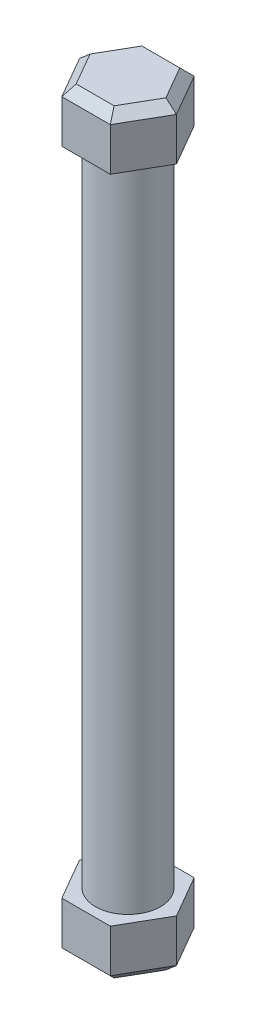
ISO-10303-21;
HEADER;
FILE_DESCRIPTION(('STEP AP214'),'2;1');
FILE_NAME('part.step','',(''),(''),'','','');
FILE_SCHEMA(('AUTOMOTIVE_DESIGN { 1 0 10303 214 1 1 1 1 }'));
ENDSEC;
DATA;
#1=APPLICATION_CONTEXT('core data for automotive mechanical design processes');
#2=APPLICATION_PROTOCOL_DEFINITION('international standard','automotive_design',2000,#1);
#3=PRODUCT_CONTEXT('',#1,'mechanical');
#4=PRODUCT('Part','Part','',(#3));
#5=PRODUCT_RELATED_PRODUCT_CATEGORY('part','',(#4));
#6=PRODUCT_DEFINITION_FORMATION('','',#4);
#7=PRODUCT_DEFINITION_CONTEXT('part definition',#1,'design');
#8=PRODUCT_DEFINITION('design','',#6,#7);
#9=PRODUCT_DEFINITION_SHAPE('','',#8);
#10=(LENGTH_UNIT() NAMED_UNIT(*) SI_UNIT(.MILLI.,.METRE.));
#11=(NAMED_UNIT(*) PLANE_ANGLE_UNIT() SI_UNIT($,.RADIAN.));
#12=(NAMED_UNIT(*) SI_UNIT($,.STERADIAN.) SOLID_ANGLE_UNIT());
#13=UNCERTAINTY_MEASURE_WITH_UNIT(LENGTH_MEASURE(1.E-05),#10,'distance_accuracy_value','');
#14=(GEOMETRIC_REPRESENTATION_CONTEXT(3) GLOBAL_UNCERTAINTY_ASSIGNED_CONTEXT((#13)) GLOBAL_UNIT_ASSIGNED_CONTEXT((#10,
#11,#12)) REPRESENTATION_CONTEXT('',''));
#15=CARTESIAN_POINT('',(0.,0.,0.));
#16=DIRECTION('',(0.,0.,1.));
#17=DIRECTION('',(1.,0.,0.));
#18=AXIS2_PLACEMENT_3D('',#15,#16,#17);
#19=CARTESIAN_POINT('',(0.,50.,0.));
#20=DIRECTION('',(0.,-1.,0.));
#21=DIRECTION('',(0.,0.,-1.));
#22=AXIS2_PLACEMENT_3D('',#19,#20,#21);
#23=CYLINDRICAL_SURFACE('',#22,2.5);
#24=CARTESIAN_POINT('',(0.,50.,0.));
#25=DIRECTION('',(0.,1.,0.));
#26=DIRECTION('',(0.,0.,1.));
#27=AXIS2_PLACEMENT_3D('',#24,#25,#26);
#28=CIRCLE('',#27,2.5);
#29=CARTESIAN_POINT('',(0.,50.,2.5));
#30=VERTEX_POINT('',#29);
#31=EDGE_CURVE('E268',#30,#30,#28,.T.);
#32=ORIENTED_EDGE('',*,*,#31,.F.);
#33=EDGE_LOOP('',(#32));
#34=FACE_BOUND('',#33,.T.);
#35=CARTESIAN_POINT('',(0.,0.,0.));
#36=DIRECTION('',(0.,1.,0.));
#37=DIRECTION('',(0.,0.,1.));
#38=AXIS2_PLACEMENT_3D('',#35,#36,#37);
#39=CIRCLE('',#38,2.5);
#40=CARTESIAN_POINT('',(0.,0.,2.5));
#41=VERTEX_POINT('',#40);
#42=EDGE_CURVE('E176',#41,#41,#39,.T.);
#43=ORIENTED_EDGE('',*,*,#42,.T.);
#44=EDGE_LOOP('',(#43));
#45=FACE_BOUND('',#44,.T.);
#46=ADVANCED_FACE('F41',(#34,#45),#23,.T.);
#47=CARTESIAN_POINT('',(1.86001855861433,54.,3.22164664654096));
#48=DIRECTION('',(-0.866025403784441,0.,-0.499999999999995));
#49=DIRECTION('',(-0.499999999999995,0.,0.866025403784442));
#50=AXIS2_PLACEMENT_3D('',#47,#48,#49);
#51=PLANE('',#50);
#52=DIRECTION('',(0.,-1.,0.));
#53=VECTOR('',#52,1.);
#54=CARTESIAN_POINT('',(3.72003711722858,54.,0.));
#55=LINE('',#54,#53);
#56=CARTESIAN_POINT('',(3.72003711722858,53.3,0.));
#57=VERTEX_POINT('',#56);
#58=CARTESIAN_POINT('',(3.72003711722858,50.,0.));
#59=VERTEX_POINT('',#58);
#60=EDGE_CURVE('E265',#57,#59,#55,.T.);
#61=ORIENTED_EDGE('',*,*,#60,.F.);
#62=DIRECTION('',(-0.499999999999995,0.,0.866025403784442));
#63=VECTOR('',#62,1.);
#64=CARTESIAN_POINT('',(1.86001855861433,53.3,3.22164664654096));
#65=LINE('',#64,#63);
#66=CARTESIAN_POINT('',(1.86001855861433,53.3,3.22164664654096));
#67=VERTEX_POINT('',#66);
#68=EDGE_CURVE('E311',#57,#67,#65,.T.);
#69=ORIENTED_EDGE('',*,*,#68,.T.);
#70=DIRECTION('',(0.,-1.,0.));
#71=VECTOR('',#70,1.);
#72=CARTESIAN_POINT('',(1.86001855861433,54.,3.22164664654096));
#73=LINE('',#72,#71);
#74=CARTESIAN_POINT('',(1.86001855861433,50.,3.22164664654096));
#75=VERTEX_POINT('',#74);
#76=EDGE_CURVE('E250',#67,#75,#73,.T.);
#77=ORIENTED_EDGE('',*,*,#76,.T.);
#78=DIRECTION('',(0.499999999999995,0.,-0.866025403784441));
#79=VECTOR('',#78,1.);
#80=CARTESIAN_POINT('',(1.86001855861433,50.,3.22164664654096));
#81=LINE('',#80,#79);
#82=EDGE_CURVE('E225',#75,#59,#81,.T.);
#83=ORIENTED_EDGE('',*,*,#82,.T.);
#84=EDGE_LOOP('',(#61,#69,#77,#83));
#85=FACE_BOUND('',#84,.T.);
#86=ADVANCED_FACE('F427',(#85),#51,.F.);
#87=CARTESIAN_POINT('',(3.72003711722858,54.,0.));
#88=DIRECTION('',(-0.866025403784438,0.,0.500000000000001));
#89=DIRECTION('',(0.500000000000001,0.,0.866025403784438));
#90=AXIS2_PLACEMENT_3D('',#87,#88,#89);
#91=PLANE('',#90);
#92=DIRECTION('',(0.,-1.,0.));
#93=VECTOR('',#92,1.);
#94=CARTESIAN_POINT('',(1.86001855861428,54.,-3.22164664654098));
#95=LINE('',#94,#93);
#96=CARTESIAN_POINT('',(1.86001855861428,53.3,-3.22164664654098));
#97=VERTEX_POINT('',#96);
#98=CARTESIAN_POINT('',(1.86001855861428,50.,-3.22164664654098));
#99=VERTEX_POINT('',#98);
#100=EDGE_CURVE('E262',#97,#99,#95,.T.);
#101=ORIENTED_EDGE('',*,*,#100,.F.);
#102=DIRECTION('',(0.500000000000001,0.,0.866025403784438));
#103=VECTOR('',#102,1.);
#104=CARTESIAN_POINT('',(3.72003711722858,53.3,0.));
#105=LINE('',#104,#103);
#106=EDGE_CURVE('E308',#97,#57,#105,.T.);
#107=ORIENTED_EDGE('',*,*,#106,.T.);
#108=ORIENTED_EDGE('',*,*,#60,.T.);
#109=DIRECTION('',(-0.500000000000001,0.,-0.866025403784438));
#110=VECTOR('',#109,1.);
#111=CARTESIAN_POINT('',(3.72003711722858,50.,0.));
#112=LINE('',#111,#110);
#113=EDGE_CURVE('E229',#59,#99,#112,.T.);
#114=ORIENTED_EDGE('',*,*,#113,.T.);
#115=EDGE_LOOP('',(#101,#107,#108,#114));
#116=FACE_BOUND('',#115,.T.);
#117=ADVANCED_FACE('F433',(#116),#91,.F.);
#118=CARTESIAN_POINT('',(1.86001855861428,54.,-3.22164664654098));
#119=DIRECTION('',(0.,0.,1.));
#120=DIRECTION('',(1.,0.,0.));
#121=AXIS2_PLACEMENT_3D('',#118,#119,#120);
#122=PLANE('',#121);
#123=DIRECTION('',(0.,-1.,0.));
#124=VECTOR('',#123,1.);
#125=CARTESIAN_POINT('',(-1.8600185586143,54.,-3.22164664654097));
#126=LINE('',#125,#124);
#127=CARTESIAN_POINT('',(-1.8600185586143,53.3,-3.22164664654097));
#128=VERTEX_POINT('',#127);
#129=CARTESIAN_POINT('',(-1.8600185586143,50.,-3.22164664654097));
#130=VERTEX_POINT('',#129);
#131=EDGE_CURVE('E259',#128,#130,#126,.T.);
#132=ORIENTED_EDGE('',*,*,#131,.F.);
#133=DIRECTION('',(1.,0.,0.));
#134=VECTOR('',#133,1.);
#135=CARTESIAN_POINT('',(1.86001855861428,53.3,-3.22164664654098));
#136=LINE('',#135,#134);
#137=EDGE_CURVE('E305',#128,#97,#136,.T.);
#138=ORIENTED_EDGE('',*,*,#137,.T.);
#139=ORIENTED_EDGE('',*,*,#100,.T.);
#140=DIRECTION('',(-1.,0.,0.));
#141=VECTOR('',#140,1.);
#142=CARTESIAN_POINT('',(1.86001855861428,50.,-3.22164664654098));
#143=LINE('',#142,#141);
#144=EDGE_CURVE('E234',#99,#130,#143,.T.);
#145=ORIENTED_EDGE('',*,*,#144,.T.);
#146=EDGE_LOOP('',(#132,#138,#139,#145));
#147=FACE_BOUND('',#146,.T.);
#148=ADVANCED_FACE('F668',(#147),#122,.F.);
#149=CARTESIAN_POINT('',(-1.8600185586143,54.,-3.22164664654097));
#150=DIRECTION('',(0.866025403784442,0.,0.499999999999995));
#151=DIRECTION('',(0.499999999999995,0.,-0.866025403784442));
#152=AXIS2_PLACEMENT_3D('',#149,#150,#151);
#153=PLANE('',#152);
#154=DIRECTION('',(0.,-1.,0.));
#155=VECTOR('',#154,1.);
#156=CARTESIAN_POINT('',(-3.72003711722858,54.,0.));
#157=LINE('',#156,#155);
#158=CARTESIAN_POINT('',(-3.72003711722858,53.3,0.));
#159=VERTEX_POINT('',#158);
#160=CARTESIAN_POINT('',(-3.72003711722858,50.,0.));
#161=VERTEX_POINT('',#160);
#162=EDGE_CURVE('E256',#159,#161,#157,.T.);
#163=ORIENTED_EDGE('',*,*,#162,.F.);
#164=DIRECTION('',(0.499999999999995,0.,-0.866025403784442));
#165=VECTOR('',#164,1.);
#166=CARTESIAN_POINT('',(-1.8600185586143,53.3,-3.22164664654097));
#167=LINE('',#166,#165);
#168=EDGE_CURVE('E302',#159,#128,#167,.T.);
#169=ORIENTED_EDGE('',*,*,#168,.T.);
#170=ORIENTED_EDGE('',*,*,#131,.T.);
#171=DIRECTION('',(-0.499999999999995,0.,0.866025403784441));
#172=VECTOR('',#171,1.);
#173=CARTESIAN_POINT('',(-1.8600185586143,50.,-3.22164664654097));
#174=LINE('',#173,#172);
#175=EDGE_CURVE('E238',#130,#161,#174,.T.);
#176=ORIENTED_EDGE('',*,*,#175,.T.);
#177=EDGE_LOOP('',(#163,#169,#170,#176));
#178=FACE_BOUND('',#177,.T.);
#179=ADVANCED_FACE('F659',(#178),#153,.F.);
#180=CARTESIAN_POINT('',(-3.72003711722858,54.,0.));
#181=DIRECTION('',(0.866025403784435,0.,-0.500000000000007));
#182=DIRECTION('',(-0.500000000000007,0.,-0.866025403784435));
#183=AXIS2_PLACEMENT_3D('',#180,#181,#182);
#184=PLANE('',#183);
#185=DIRECTION('',(0.,-1.,0.));
#186=VECTOR('',#185,1.);
#187=CARTESIAN_POINT('',(-1.86001855861426,54.,3.221646646541));
#188=LINE('',#187,#186);
#189=CARTESIAN_POINT('',(-1.86001855861426,53.3,3.221646646541));
#190=VERTEX_POINT('',#189);
#191=CARTESIAN_POINT('',(-1.86001855861426,50.,3.221646646541));
#192=VERTEX_POINT('',#191);
#193=EDGE_CURVE('E253',#190,#192,#188,.T.);
#194=ORIENTED_EDGE('',*,*,#193,.F.);
#195=DIRECTION('',(-0.500000000000007,0.,-0.866025403784435));
#196=VECTOR('',#195,1.);
#197=CARTESIAN_POINT('',(-3.72003711722858,53.3,0.));
#198=LINE('',#197,#196);
#199=EDGE_CURVE('E299',#190,#159,#198,.T.);
#200=ORIENTED_EDGE('',*,*,#199,.T.);
#201=ORIENTED_EDGE('',*,*,#162,.T.);
#202=DIRECTION('',(0.500000000000007,0.,0.866025403784435));
#203=VECTOR('',#202,1.);
#204=CARTESIAN_POINT('',(-3.72003711722858,50.,0.));
#205=LINE('',#204,#203);
#206=EDGE_CURVE('E242',#161,#192,#205,.T.);
#207=ORIENTED_EDGE('',*,*,#206,.T.);
#208=EDGE_LOOP('',(#194,#200,#201,#207));
#209=FACE_BOUND('',#208,.T.);
#210=ADVANCED_FACE('F650',(#209),#184,.F.);
#211=CARTESIAN_POINT('',(-1.86001855861426,54.,3.221646646541));
#212=DIRECTION('',(0.,0.,-1.));
#213=DIRECTION('',(-1.,0.,0.));
#214=AXIS2_PLACEMENT_3D('',#211,#212,#213);
#215=PLANE('',#214);
#216=ORIENTED_EDGE('',*,*,#76,.F.);
#217=DIRECTION('',(-1.,0.,0.));
#218=VECTOR('',#217,1.);
#219=CARTESIAN_POINT('',(-1.86001855861426,53.3,3.221646646541));
#220=LINE('',#219,#218);
#221=EDGE_CURVE('E295',#67,#190,#220,.T.);
#222=ORIENTED_EDGE('',*,*,#221,.T.);
#223=ORIENTED_EDGE('',*,*,#193,.T.);
#224=DIRECTION('',(1.,0.,0.));
#225=VECTOR('',#224,1.);
#226=CARTESIAN_POINT('',(-1.86001855861426,50.,3.221646646541));
#227=LINE('',#226,#225);
#228=EDGE_CURVE('E246',#192,#75,#227,.T.);
#229=ORIENTED_EDGE('',*,*,#228,.T.);
#230=EDGE_LOOP('',(#216,#222,#223,#229));
#231=FACE_BOUND('',#230,.T.);
#232=ADVANCED_FACE('F641',(#231),#215,.F.);
#233=CARTESIAN_POINT('',(0.,54.,0.));
#234=DIRECTION('',(0.,1.,0.));
#235=DIRECTION('',(0.,0.,1.));
#236=AXIS2_PLACEMENT_3D('',#233,#234,#235);
#237=PLANE('',#236);
#238=DIRECTION('',(0.500000000000007,0.,0.866025403784435));
#239=VECTOR('',#238,1.);
#240=CARTESIAN_POINT('',(-1.25380077596517,54.,2.871646646541));
#241=LINE('',#240,#239);
#242=CARTESIAN_POINT('',(-2.91174674036312,54.,0.));
#243=VERTEX_POINT('',#242);
#244=CARTESIAN_POINT('',(-1.45587337018154,54.,2.52164664654101));
#245=VERTEX_POINT('',#244);
#246=EDGE_CURVE('E288',#243,#245,#241,.T.);
#247=ORIENTED_EDGE('',*,*,#246,.T.);
#248=DIRECTION('',(1.,0.,0.));
#249=VECTOR('',#248,1.);
#250=CARTESIAN_POINT('',(1.86001855861432,54.,2.52164664654097));
#251=LINE('',#250,#249);
#252=CARTESIAN_POINT('',(1.45587337018159,54.,2.52164664654098));
#253=VERTEX_POINT('',#252);
#254=EDGE_CURVE('E291',#245,#253,#251,.T.);
#255=ORIENTED_EDGE('',*,*,#254,.T.);
#256=DIRECTION('',(0.499999999999995,0.,-0.866025403784442));
#257=VECTOR('',#256,1.);
#258=CARTESIAN_POINT('',(3.11381933457948,54.,-0.349999999999989));
#259=LINE('',#258,#257);
#260=CARTESIAN_POINT('',(2.91174674036312,54.,0.));
#261=VERTEX_POINT('',#260);
#262=EDGE_CURVE('E272',#253,#261,#259,.T.);
#263=ORIENTED_EDGE('',*,*,#262,.T.);
#264=DIRECTION('',(-0.500000000000001,0.,-0.866025403784438));
#265=VECTOR('',#264,1.);
#266=CARTESIAN_POINT('',(1.25380077596519,54.,-2.87164664654099));
#267=LINE('',#266,#265);
#268=CARTESIAN_POINT('',(1.45587337018155,54.,-2.521646646541));
#269=VERTEX_POINT('',#268);
#270=EDGE_CURVE('E279',#261,#269,#267,.T.);
#271=ORIENTED_EDGE('',*,*,#270,.T.);
#272=DIRECTION('',(-1.,0.,0.));
#273=VECTOR('',#272,1.);
#274=CARTESIAN_POINT('',(-1.8600185586143,54.,-2.52164664654099));
#275=LINE('',#274,#273);
#276=CARTESIAN_POINT('',(-1.45587337018157,54.,-2.52164664654099));
#277=VERTEX_POINT('',#276);
#278=EDGE_CURVE('E282',#269,#277,#275,.T.);
#279=ORIENTED_EDGE('',*,*,#278,.T.);
#280=DIRECTION('',(-0.499999999999995,0.,0.866025403784442));
#281=VECTOR('',#280,1.);
#282=CARTESIAN_POINT('',(-3.11381933457948,54.,0.350000000000016));
#283=LINE('',#282,#281);
#284=EDGE_CURVE('E285',#277,#243,#283,.T.);
#285=ORIENTED_EDGE('',*,*,#284,.T.);
#286=EDGE_LOOP('',(#247,#255,#263,#271,#279,#285));
#287=FACE_BOUND('',#286,.T.);
#288=ADVANCED_FACE('F632',(#287),#237,.T.);
#289=CARTESIAN_POINT('',(0.,50.,0.));
#290=DIRECTION('',(0.,1.,0.));
#291=DIRECTION('',(0.,0.,1.));
#292=AXIS2_PLACEMENT_3D('',#289,#290,#291);
#293=PLANE('',#292);
#294=ORIENTED_EDGE('',*,*,#31,.T.);
#295=EDGE_LOOP('',(#294));
#296=FACE_BOUND('',#295,.T.);
#297=ORIENTED_EDGE('',*,*,#82,.F.);
#298=ORIENTED_EDGE('',*,*,#228,.F.);
#299=ORIENTED_EDGE('',*,*,#206,.F.);
#300=ORIENTED_EDGE('',*,*,#175,.F.);
#301=ORIENTED_EDGE('',*,*,#144,.F.);
#302=ORIENTED_EDGE('',*,*,#113,.F.);
#303=EDGE_LOOP('',(#297,#298,#299,#300,#301,#302));
#304=FACE_BOUND('',#303,.T.);
#305=ADVANCED_FACE('F481',(#296,#304),#293,.F.);
#306=CARTESIAN_POINT('',(0.,54.,-2.52164664654099));
#307=DIRECTION('',(0.,0.707106781186544,-0.70710678118655));
#308=DIRECTION('',(1.,0.,0.));
#309=AXIS2_PLACEMENT_3D('',#306,#307,#308);
#310=PLANE('',#309);
#311=DIRECTION('',(-0.377964473009225,0.65465367070798,0.654653670707976));
#312=VECTOR('',#311,1.);
#313=CARTESIAN_POINT('',(1.24789146015562,54.3602352352202,-2.16141141132086));
#314=LINE('',#313,#312);
#315=EDGE_CURVE('E328',#97,#269,#314,.T.);
#316=ORIENTED_EDGE('',*,*,#315,.F.);
#317=ORIENTED_EDGE('',*,*,#137,.F.);
#318=DIRECTION('',(0.377964473009229,0.65465367070798,0.654653670707973));
#319=VECTOR('',#318,1.);
#320=CARTESIAN_POINT('',(-1.24789146015563,54.3602352352202,-2.16141141132085));
#321=LINE('',#320,#319);
#322=EDGE_CURVE('E230',#277,#128,#321,.F.);
#323=ORIENTED_EDGE('',*,*,#322,.F.);
#324=ORIENTED_EDGE('',*,*,#278,.F.);
#325=EDGE_LOOP('',(#316,#317,#323,#324));
#326=FACE_BOUND('',#325,.T.);
#327=ADVANCED_FACE('F475',(#326),#310,.T.);
#328=CARTESIAN_POINT('',(-2.18381005527235,54.,-1.26082332327048));
#329=DIRECTION('',(-0.612372435695799,0.707106781186544,-0.353553390593272));
#330=DIRECTION('',(0.499999999999995,0.,-0.866025403784442));
#331=AXIS2_PLACEMENT_3D('',#328,#329,#330);
#332=PLANE('',#331);
#333=ORIENTED_EDGE('',*,*,#322,.T.);
#334=ORIENTED_EDGE('',*,*,#168,.F.);
#335=DIRECTION('',(0.755928946018452,0.65465367070798,0.));
#336=VECTOR('',#335,1.);
#337=CARTESIAN_POINT('',(-2.49578292031125,54.3602352352202,0.));
#338=LINE('',#337,#336);
#339=EDGE_CURVE('E324',#243,#159,#338,.F.);
#340=ORIENTED_EDGE('',*,*,#339,.F.);
#341=ORIENTED_EDGE('',*,*,#284,.F.);
#342=EDGE_LOOP('',(#333,#334,#340,#341));
#343=FACE_BOUND('',#342,.T.);
#344=ADVANCED_FACE('F468',(#343),#332,.T.);
#345=CARTESIAN_POINT('',(2.18381005527234,54.,-1.2608233232705));
#346=DIRECTION('',(0.612372435695797,0.707106781186544,-0.353553390593276));
#347=DIRECTION('',(0.500000000000001,0.,0.866025403784438));
#348=AXIS2_PLACEMENT_3D('',#345,#346,#347);
#349=PLANE('',#348);
#350=ORIENTED_EDGE('',*,*,#315,.T.);
#351=ORIENTED_EDGE('',*,*,#270,.F.);
#352=DIRECTION('',(-0.755928946018451,0.654653670707981,0.));
#353=VECTOR('',#352,1.);
#354=CARTESIAN_POINT('',(2.49578292031126,54.3602352352201,0.));
#355=LINE('',#354,#353);
#356=EDGE_CURVE('E320',#57,#261,#355,.T.);
#357=ORIENTED_EDGE('',*,*,#356,.F.);
#358=ORIENTED_EDGE('',*,*,#106,.F.);
#359=EDGE_LOOP('',(#350,#351,#357,#358));
#360=FACE_BOUND('',#359,.T.);
#361=ADVANCED_FACE('F461',(#360),#349,.T.);
#362=CARTESIAN_POINT('',(-2.18381005527233,54.,1.26082332327051));
#363=DIRECTION('',(-0.612372435695794,0.707106781186544,0.35355339059328));
#364=DIRECTION('',(-0.500000000000007,0.,-0.866025403784435));
#365=AXIS2_PLACEMENT_3D('',#362,#363,#364);
#366=PLANE('',#365);
#367=ORIENTED_EDGE('',*,*,#339,.T.);
#368=ORIENTED_EDGE('',*,*,#199,.F.);
#369=DIRECTION('',(0.37796447300922,0.65465367070798,-0.654653670707979));
#370=VECTOR('',#369,1.);
#371=CARTESIAN_POINT('',(-1.2478914601556,54.3602352352202,2.16141141132086));
#372=LINE('',#371,#370);
#373=EDGE_CURVE('E317',#245,#190,#372,.F.);
#374=ORIENTED_EDGE('',*,*,#373,.F.);
#375=ORIENTED_EDGE('',*,*,#246,.F.);
#376=EDGE_LOOP('',(#367,#368,#374,#375));
#377=FACE_BOUND('',#376,.T.);
#378=ADVANCED_FACE('F454',(#377),#366,.T.);
#379=CARTESIAN_POINT('',(2.18381005527236,54.,1.26082332327049));
#380=DIRECTION('',(0.612372435695799,0.707106781186544,0.353553390593272));
#381=DIRECTION('',(-0.499999999999995,0.,0.866025403784442));
#382=AXIS2_PLACEMENT_3D('',#379,#380,#381);
#383=PLANE('',#382);
#384=ORIENTED_EDGE('',*,*,#356,.T.);
#385=ORIENTED_EDGE('',*,*,#262,.F.);
#386=DIRECTION('',(0.377964473009231,-0.654653670707981,0.654653670707972));
#387=VECTOR('',#386,1.);
#388=CARTESIAN_POINT('',(1.24789146015566,54.3602352352201,2.16141141132084));
#389=LINE('',#388,#387);
#390=EDGE_CURVE('E276',#67,#253,#389,.F.);
#391=ORIENTED_EDGE('',*,*,#390,.F.);
#392=ORIENTED_EDGE('',*,*,#68,.F.);
#393=EDGE_LOOP('',(#384,#385,#391,#392));
#394=FACE_BOUND('',#393,.T.);
#395=ADVANCED_FACE('F447',(#394),#383,.T.);
#396=CARTESIAN_POINT('',(0.,54.,2.52164664654099));
#397=DIRECTION('',(0.,0.707106781186545,0.70710678118655));
#398=DIRECTION('',(-1.,0.,0.));
#399=AXIS2_PLACEMENT_3D('',#396,#397,#398);
#400=PLANE('',#399);
#401=ORIENTED_EDGE('',*,*,#373,.T.);
#402=ORIENTED_EDGE('',*,*,#221,.F.);
#403=ORIENTED_EDGE('',*,*,#390,.T.);
#404=ORIENTED_EDGE('',*,*,#254,.F.);
#405=EDGE_LOOP('',(#401,#402,#403,#404));
#406=FACE_BOUND('',#405,.T.);
#407=ADVANCED_FACE('F441',(#406),#400,.T.);
#408=CARTESIAN_POINT('',(1.86001855861433,-4.,-3.22164664654096));
#409=DIRECTION('',(-0.866025403784441,0.,0.499999999999995));
#410=DIRECTION('',(0.499999999999995,0.,0.866025403784442));
#411=AXIS2_PLACEMENT_3D('',#408,#409,#410);
#412=PLANE('',#411);
#413=DIRECTION('',(0.,1.,0.));
#414=VECTOR('',#413,1.);
#415=CARTESIAN_POINT('',(3.72003711722858,-4.,0.));
#416=LINE('',#415,#414);
#417=CARTESIAN_POINT('',(3.72003711722858,-3.29999999999999,0.));
#418=VERTEX_POINT('',#417);
#419=CARTESIAN_POINT('',(3.72003711722858,0.,0.));
#420=VERTEX_POINT('',#419);
#421=EDGE_CURVE('E167',#418,#420,#416,.T.);
#422=ORIENTED_EDGE('',*,*,#421,.F.);
#423=DIRECTION('',(-0.499999999999995,0.,-0.866025403784442));
#424=VECTOR('',#423,1.);
#425=CARTESIAN_POINT('',(1.86001855861433,-3.29999999999999,-3.22164664654096));
#426=LINE('',#425,#424);
#427=CARTESIAN_POINT('',(1.86001855861433,-3.29999999999999,-3.22164664654096));
#428=VERTEX_POINT('',#427);
#429=EDGE_CURVE('E11',#418,#428,#426,.T.);
#430=ORIENTED_EDGE('',*,*,#429,.T.);
#431=DIRECTION('',(0.,1.,0.));
#432=VECTOR('',#431,1.);
#433=CARTESIAN_POINT('',(1.86001855861433,-4.,-3.22164664654096));
#434=LINE('',#433,#432);
#435=CARTESIAN_POINT('',(1.86001855861433,0.,-3.22164664654096));
#436=VERTEX_POINT('',#435);
#437=EDGE_CURVE('E191',#428,#436,#434,.T.);
#438=ORIENTED_EDGE('',*,*,#437,.T.);
#439=DIRECTION('',(0.499999999999995,0.,0.866025403784441));
#440=VECTOR('',#439,1.);
#441=CARTESIAN_POINT('',(1.86001855861433,0.,-3.22164664654096));
#442=LINE('',#441,#440);
#443=EDGE_CURVE('E183',#436,#420,#442,.T.);
#444=ORIENTED_EDGE('',*,*,#443,.T.);
#445=EDGE_LOOP('',(#422,#430,#438,#444));
#446=FACE_BOUND('',#445,.T.);
#447=ADVANCED_FACE('F189',(#446),#412,.F.);
#448=CARTESIAN_POINT('',(3.72003711722858,-4.,0.));
#449=DIRECTION('',(-0.866025403784438,0.,-0.500000000000001));
#450=DIRECTION('',(-0.500000000000001,0.,0.866025403784438));
#451=AXIS2_PLACEMENT_3D('',#448,#449,#450);
#452=PLANE('',#451);
#453=DIRECTION('',(0.,1.,0.));
#454=VECTOR('',#453,1.);
#455=CARTESIAN_POINT('',(1.86001855861428,-4.,3.22164664654098));
#456=LINE('',#455,#454);
#457=CARTESIAN_POINT('',(1.86001855861428,-3.29999999999999,3.22164664654098));
#458=VERTEX_POINT('',#457);
#459=CARTESIAN_POINT('',(1.86001855861428,0.,3.22164664654098));
#460=VERTEX_POINT('',#459);
#461=EDGE_CURVE('E177',#458,#460,#456,.T.);
#462=ORIENTED_EDGE('',*,*,#461,.F.);
#463=DIRECTION('',(0.500000000000001,0.,-0.866025403784438));
#464=VECTOR('',#463,1.);
#465=CARTESIAN_POINT('',(3.72003711722858,-3.29999999999999,0.));
#466=LINE('',#465,#464);
#467=EDGE_CURVE('E52',#458,#418,#466,.T.);
#468=ORIENTED_EDGE('',*,*,#467,.T.);
#469=ORIENTED_EDGE('',*,*,#421,.T.);
#470=DIRECTION('',(-0.500000000000001,0.,0.866025403784438));
#471=VECTOR('',#470,1.);
#472=CARTESIAN_POINT('',(3.72003711722858,0.,0.));
#473=LINE('',#472,#471);
#474=EDGE_CURVE('E170',#420,#460,#473,.T.);
#475=ORIENTED_EDGE('',*,*,#474,.T.);
#476=EDGE_LOOP('',(#462,#468,#469,#475));
#477=FACE_BOUND('',#476,.T.);
#478=ADVANCED_FACE('F169',(#477),#452,.F.);
#479=CARTESIAN_POINT('',(1.86001855861428,-4.,3.22164664654098));
#480=DIRECTION('',(0.,0.,-1.));
#481=DIRECTION('',(-1.,0.,0.));
#482=AXIS2_PLACEMENT_3D('',#479,#480,#481);
#483=PLANE('',#482);
#484=DIRECTION('',(0.,1.,0.));
#485=VECTOR('',#484,1.);
#486=CARTESIAN_POINT('',(-1.8600185586143,-4.,3.22164664654097));
#487=LINE('',#486,#485);
#488=CARTESIAN_POINT('',(-1.8600185586143,-3.29999999999999,3.22164664654097));
#489=VERTEX_POINT('',#488);
#490=CARTESIAN_POINT('',(-1.8600185586143,0.,3.22164664654097));
#491=VERTEX_POINT('',#490);
#492=EDGE_CURVE('E220',#489,#491,#487,.T.);
#493=ORIENTED_EDGE('',*,*,#492,.F.);
#494=DIRECTION('',(1.,0.,0.));
#495=VECTOR('',#494,1.);
#496=CARTESIAN_POINT('',(1.86001855861428,-3.29999999999999,3.22164664654098));
#497=LINE('',#496,#495);
#498=EDGE_CURVE('E67',#489,#458,#497,.T.);
#499=ORIENTED_EDGE('',*,*,#498,.T.);
#500=ORIENTED_EDGE('',*,*,#461,.T.);
#501=DIRECTION('',(-1.,0.,0.));
#502=VECTOR('',#501,1.);
#503=CARTESIAN_POINT('',(1.86001855861428,0.,3.22164664654098));
#504=LINE('',#503,#502);
#505=EDGE_CURVE('E186',#460,#491,#504,.T.);
#506=ORIENTED_EDGE('',*,*,#505,.T.);
#507=EDGE_LOOP('',(#493,#499,#500,#506));
#508=FACE_BOUND('',#507,.T.);
#509=ADVANCED_FACE('F574',(#508),#483,.F.);
#510=CARTESIAN_POINT('',(-1.8600185586143,-4.,3.22164664654097));
#511=DIRECTION('',(0.866025403784442,0.,-0.499999999999995));
#512=DIRECTION('',(-0.499999999999995,0.,-0.866025403784442));
#513=AXIS2_PLACEMENT_3D('',#510,#511,#512);
#514=PLANE('',#513);
#515=DIRECTION('',(0.,1.,0.));
#516=VECTOR('',#515,1.);
#517=CARTESIAN_POINT('',(-3.72003711722858,-4.,0.));
#518=LINE('',#517,#516);
#519=CARTESIAN_POINT('',(-3.72003711722858,-3.29999999999999,0.));
#520=VERTEX_POINT('',#519);
#521=CARTESIAN_POINT('',(-3.72003711722858,0.,0.));
#522=VERTEX_POINT('',#521);
#523=EDGE_CURVE('E217',#520,#522,#518,.T.);
#524=ORIENTED_EDGE('',*,*,#523,.F.);
#525=DIRECTION('',(0.499999999999995,0.,0.866025403784442));
#526=VECTOR('',#525,1.);
#527=CARTESIAN_POINT('',(-1.8600185586143,-3.29999999999999,3.22164664654097));
#528=LINE('',#527,#526);
#529=EDGE_CURVE('E360',#520,#489,#528,.T.);
#530=ORIENTED_EDGE('',*,*,#529,.T.);
#531=ORIENTED_EDGE('',*,*,#492,.T.);
#532=DIRECTION('',(-0.499999999999995,0.,-0.866025403784441));
#533=VECTOR('',#532,1.);
#534=CARTESIAN_POINT('',(-1.8600185586143,0.,3.22164664654097));
#535=LINE('',#534,#533);
#536=EDGE_CURVE('E201',#491,#522,#535,.T.);
#537=ORIENTED_EDGE('',*,*,#536,.T.);
#538=EDGE_LOOP('',(#524,#530,#531,#537));
#539=FACE_BOUND('',#538,.T.);
#540=ADVANCED_FACE('F415',(#539),#514,.F.);
#541=CARTESIAN_POINT('',(-3.72003711722858,-4.,0.));
#542=DIRECTION('',(0.866025403784435,0.,0.500000000000007));
#543=DIRECTION('',(0.500000000000007,0.,-0.866025403784435));
#544=AXIS2_PLACEMENT_3D('',#541,#542,#543);
#545=PLANE('',#544);
#546=DIRECTION('',(0.,1.,0.));
#547=VECTOR('',#546,1.);
#548=CARTESIAN_POINT('',(-1.86001855861426,-4.,-3.221646646541));
#549=LINE('',#548,#547);
#550=CARTESIAN_POINT('',(-1.86001855861426,-3.29999999999999,-3.221646646541));
#551=VERTEX_POINT('',#550);
#552=CARTESIAN_POINT('',(-1.86001855861426,0.,-3.221646646541));
#553=VERTEX_POINT('',#552);
#554=EDGE_CURVE('E214',#551,#553,#549,.T.);
#555=ORIENTED_EDGE('',*,*,#554,.F.);
#556=DIRECTION('',(-0.500000000000007,0.,0.866025403784435));
#557=VECTOR('',#556,1.);
#558=CARTESIAN_POINT('',(-3.72003711722858,-3.29999999999999,0.));
#559=LINE('',#558,#557);
#560=EDGE_CURVE('E357',#551,#520,#559,.T.);
#561=ORIENTED_EDGE('',*,*,#560,.T.);
#562=ORIENTED_EDGE('',*,*,#523,.T.);
#563=DIRECTION('',(0.500000000000007,0.,-0.866025403784435));
#564=VECTOR('',#563,1.);
#565=CARTESIAN_POINT('',(-3.72003711722858,0.,0.));
#566=LINE('',#565,#564);
#567=EDGE_CURVE('E205',#522,#553,#566,.T.);
#568=ORIENTED_EDGE('',*,*,#567,.T.);
#569=EDGE_LOOP('',(#555,#561,#562,#568));
#570=FACE_BOUND('',#569,.T.);
#571=ADVANCED_FACE('F412',(#570),#545,.F.);
#572=CARTESIAN_POINT('',(-1.86001855861426,-4.,-3.221646646541));
#573=DIRECTION('',(0.,0.,1.));
#574=DIRECTION('',(1.,0.,0.));
#575=AXIS2_PLACEMENT_3D('',#572,#573,#574);
#576=PLANE('',#575);
#577=ORIENTED_EDGE('',*,*,#437,.F.);
#578=DIRECTION('',(-1.,0.,0.));
#579=VECTOR('',#578,1.);
#580=CARTESIAN_POINT('',(-1.86001855861426,-3.29999999999999,-3.221646646541));
#581=LINE('',#580,#579);
#582=EDGE_CURVE('E353',#428,#551,#581,.T.);
#583=ORIENTED_EDGE('',*,*,#582,.T.);
#584=ORIENTED_EDGE('',*,*,#554,.T.);
#585=DIRECTION('',(1.,0.,0.));
#586=VECTOR('',#585,1.);
#587=CARTESIAN_POINT('',(-1.86001855861426,0.,-3.221646646541));
#588=LINE('',#587,#586);
#589=EDGE_CURVE('E209',#553,#436,#588,.T.);
#590=ORIENTED_EDGE('',*,*,#589,.T.);
#591=EDGE_LOOP('',(#577,#583,#584,#590));
#592=FACE_BOUND('',#591,.T.);
#593=ADVANCED_FACE('F401',(#592),#576,.F.);
#594=CARTESIAN_POINT('',(0.,-4.,0.));
#595=DIRECTION('',(0.,-1.,0.));
#596=DIRECTION('',(0.,0.,-1.));
#597=AXIS2_PLACEMENT_3D('',#594,#595,#596);
#598=PLANE('',#597);
#599=DIRECTION('',(0.500000000000007,0.,-0.866025403784435));
#600=VECTOR('',#599,1.);
#601=CARTESIAN_POINT('',(-1.25380077596515,-4.,-2.87164664654099));
#602=LINE('',#601,#600);
#603=CARTESIAN_POINT('',(-2.9117467403631,-4.,0.));
#604=VERTEX_POINT('',#603);
#605=CARTESIAN_POINT('',(-1.45587337018153,-4.,-2.52164664654099));
#606=VERTEX_POINT('',#605);
#607=EDGE_CURVE('E346',#604,#606,#602,.T.);
#608=ORIENTED_EDGE('',*,*,#607,.T.);
#609=DIRECTION('',(1.,0.,0.));
#610=VECTOR('',#609,1.);
#611=CARTESIAN_POINT('',(1.86001855861432,-4.,-2.52164664654095));
#612=LINE('',#611,#610);
#613=CARTESIAN_POINT('',(1.45587337018158,-4.,-2.52164664654096));
#614=VERTEX_POINT('',#613);
#615=EDGE_CURVE('E349',#606,#614,#612,.T.);
#616=ORIENTED_EDGE('',*,*,#615,.T.);
#617=DIRECTION('',(0.499999999999995,0.,0.866025403784442));
#618=VECTOR('',#617,1.);
#619=CARTESIAN_POINT('',(3.11381933457947,-4.,0.349999999999998));
#620=LINE('',#619,#618);
#621=CARTESIAN_POINT('',(2.9117467403631,-4.,0.));
#622=VERTEX_POINT('',#621);
#623=EDGE_CURVE('E314',#614,#622,#620,.T.);
#624=ORIENTED_EDGE('',*,*,#623,.T.);
#625=DIRECTION('',(-0.500000000000001,0.,0.866025403784438));
#626=VECTOR('',#625,1.);
#627=CARTESIAN_POINT('',(1.25380077596517,-4.,2.87164664654098));
#628=LINE('',#627,#626);
#629=CARTESIAN_POINT('',(1.45587337018154,-4.,2.52164664654098));
#630=VERTEX_POINT('',#629);
#631=EDGE_CURVE('E337',#622,#630,#628,.T.);
#632=ORIENTED_EDGE('',*,*,#631,.T.);
#633=DIRECTION('',(-1.,0.,0.));
#634=VECTOR('',#633,1.);
#635=CARTESIAN_POINT('',(-1.8600185586143,-4.,2.52164664654097));
#636=LINE('',#635,#634);
#637=CARTESIAN_POINT('',(-1.45587337018156,-4.,2.52164664654097));
#638=VERTEX_POINT('',#637);
#639=EDGE_CURVE('E340',#630,#638,#636,.T.);
#640=ORIENTED_EDGE('',*,*,#639,.T.);
#641=DIRECTION('',(-0.499999999999995,0.,-0.866025403784442));
#642=VECTOR('',#641,1.);
#643=CARTESIAN_POINT('',(-3.11381933457947,-4.,-0.350000000000024));
#644=LINE('',#643,#642);
#645=EDGE_CURVE('E343',#638,#604,#644,.T.);
#646=ORIENTED_EDGE('',*,*,#645,.T.);
#647=EDGE_LOOP('',(#608,#616,#624,#632,#640,#646));
#648=FACE_BOUND('',#647,.T.);
#649=ADVANCED_FACE('F391',(#648),#598,.T.);
#650=CARTESIAN_POINT('',(0.,0.,0.));
#651=DIRECTION('',(0.,-1.,0.));
#652=DIRECTION('',(0.,0.,-1.));
#653=AXIS2_PLACEMENT_3D('',#650,#651,#652);
#654=PLANE('',#653);
#655=ORIENTED_EDGE('',*,*,#42,.F.);
#656=EDGE_LOOP('',(#655));
#657=FACE_BOUND('',#656,.T.);
#658=ORIENTED_EDGE('',*,*,#443,.F.);
#659=ORIENTED_EDGE('',*,*,#589,.F.);
#660=ORIENTED_EDGE('',*,*,#567,.F.);
#661=ORIENTED_EDGE('',*,*,#536,.F.);
#662=ORIENTED_EDGE('',*,*,#505,.F.);
#663=ORIENTED_EDGE('',*,*,#474,.F.);
#664=EDGE_LOOP('',(#658,#659,#660,#661,#662,#663));
#665=FACE_BOUND('',#664,.T.);
#666=ADVANCED_FACE('F181',(#657,#665),#654,.F.);
#667=CARTESIAN_POINT('',(0.,-4.,2.52164664654097));
#668=DIRECTION('',(0.,-0.707106781186546,0.707106781186549));
#669=DIRECTION('',(1.,0.,0.));
#670=AXIS2_PLACEMENT_3D('',#667,#668,#669);
#671=PLANE('',#670);
#672=DIRECTION('',(-0.377964473009225,-0.654653670707978,-0.654653670707977));
#673=VECTOR('',#672,1.);
#674=CARTESIAN_POINT('',(1.24789146015561,-4.36023523522014,2.16141141132084));
#675=LINE('',#674,#673);
#676=EDGE_CURVE('E197',#458,#630,#675,.T.);
#677=ORIENTED_EDGE('',*,*,#676,.F.);
#678=ORIENTED_EDGE('',*,*,#498,.F.);
#679=DIRECTION('',(0.37796447300923,-0.654653670707978,-0.654653670707975));
#680=VECTOR('',#679,1.);
#681=CARTESIAN_POINT('',(-1.24789146015562,-4.36023523522014,2.16141141132083));
#682=LINE('',#681,#680);
#683=EDGE_CURVE('E46',#638,#489,#682,.F.);
#684=ORIENTED_EDGE('',*,*,#683,.F.);
#685=ORIENTED_EDGE('',*,*,#639,.F.);
#686=EDGE_LOOP('',(#677,#678,#684,#685));
#687=FACE_BOUND('',#686,.T.);
#688=ADVANCED_FACE('F44',(#687),#671,.T.);
#689=CARTESIAN_POINT('',(-2.18381005527233,-4.,1.26082332327047));
#690=DIRECTION('',(-0.612372435695798,-0.707106781186546,0.353553390593271));
#691=DIRECTION('',(0.499999999999995,0.,0.866025403784442));
#692=AXIS2_PLACEMENT_3D('',#689,#690,#691);
#693=PLANE('',#692);
#694=ORIENTED_EDGE('',*,*,#683,.T.);
#695=ORIENTED_EDGE('',*,*,#529,.F.);
#696=DIRECTION('',(0.755928946018453,-0.654653670707978,0.));
#697=VECTOR('',#696,1.);
#698=CARTESIAN_POINT('',(-2.49578292031123,-4.36023523522014,0.));
#699=LINE('',#698,#697);
#700=EDGE_CURVE('E377',#604,#520,#699,.F.);
#701=ORIENTED_EDGE('',*,*,#700,.F.);
#702=ORIENTED_EDGE('',*,*,#645,.F.);
#703=EDGE_LOOP('',(#694,#695,#701,#702));
#704=FACE_BOUND('',#703,.T.);
#705=ADVANCED_FACE('F418',(#704),#693,.T.);
#706=CARTESIAN_POINT('',(2.18381005527232,-4.,1.26082332327049));
#707=DIRECTION('',(0.612372435695795,-0.707106781186546,0.353553390593275));
#708=DIRECTION('',(0.500000000000001,0.,-0.866025403784438));
#709=AXIS2_PLACEMENT_3D('',#706,#707,#708);
#710=PLANE('',#709);
#711=ORIENTED_EDGE('',*,*,#676,.T.);
#712=ORIENTED_EDGE('',*,*,#631,.F.);
#713=DIRECTION('',(-0.755928946018453,-0.654653670707979,0.));
#714=VECTOR('',#713,1.);
#715=CARTESIAN_POINT('',(2.49578292031124,-4.36023523522013,0.));
#716=LINE('',#715,#714);
#717=EDGE_CURVE('E373',#418,#622,#716,.T.);
#718=ORIENTED_EDGE('',*,*,#717,.F.);
#719=ORIENTED_EDGE('',*,*,#467,.F.);
#720=EDGE_LOOP('',(#711,#712,#718,#719));
#721=FACE_BOUND('',#720,.T.);
#722=ADVANCED_FACE('F385',(#721),#710,.T.);
#723=CARTESIAN_POINT('',(-2.18381005527231,-4.,-1.2608233232705));
#724=DIRECTION('',(-0.612372435695793,-0.707106781186546,-0.35355339059328));
#725=DIRECTION('',(-0.500000000000007,0.,0.866025403784435));
#726=AXIS2_PLACEMENT_3D('',#723,#724,#725);
#727=PLANE('',#726);
#728=ORIENTED_EDGE('',*,*,#700,.T.);
#729=ORIENTED_EDGE('',*,*,#560,.F.);
#730=DIRECTION('',(0.37796447300922,-0.654653670707978,0.65465367070798));
#731=VECTOR('',#730,1.);
#732=CARTESIAN_POINT('',(-1.24789146015559,-4.36023523522014,-2.16141141132085));
#733=LINE('',#732,#731);
#734=EDGE_CURVE('E370',#606,#551,#733,.F.);
#735=ORIENTED_EDGE('',*,*,#734,.F.);
#736=ORIENTED_EDGE('',*,*,#607,.F.);
#737=EDGE_LOOP('',(#728,#729,#735,#736));
#738=FACE_BOUND('',#737,.T.);
#739=ADVANCED_FACE('F409',(#738),#727,.T.);
#740=CARTESIAN_POINT('',(2.18381005527234,-4.,-1.26082332327048));
#741=DIRECTION('',(0.612372435695798,-0.707106781186546,-0.353553390593271));
#742=DIRECTION('',(-0.499999999999995,0.,-0.866025403784442));
#743=AXIS2_PLACEMENT_3D('',#740,#741,#742);
#744=PLANE('',#743);
#745=ORIENTED_EDGE('',*,*,#717,.T.);
#746=ORIENTED_EDGE('',*,*,#623,.F.);
#747=DIRECTION('',(0.377964473009232,0.654653670707979,-0.654653670707973));
#748=VECTOR('',#747,1.);
#749=CARTESIAN_POINT('',(1.24789146015565,-4.36023523522013,-2.16141141132083));
#750=LINE('',#749,#748);
#751=EDGE_CURVE('E367',#428,#614,#750,.F.);
#752=ORIENTED_EDGE('',*,*,#751,.F.);
#753=ORIENTED_EDGE('',*,*,#429,.F.);
#754=EDGE_LOOP('',(#745,#746,#752,#753));
#755=FACE_BOUND('',#754,.T.);
#756=ADVANCED_FACE('F397',(#755),#744,.T.);
#757=CARTESIAN_POINT('',(0.,-4.,-2.52164664654097));
#758=DIRECTION('',(0.,-0.707106781186546,-0.707106781186549));
#759=DIRECTION('',(-1.,0.,0.));
#760=AXIS2_PLACEMENT_3D('',#757,#758,#759);
#761=PLANE('',#760);
#762=ORIENTED_EDGE('',*,*,#734,.T.);
#763=ORIENTED_EDGE('',*,*,#582,.F.);
#764=ORIENTED_EDGE('',*,*,#751,.T.);
#765=ORIENTED_EDGE('',*,*,#615,.F.);
#766=EDGE_LOOP('',(#762,#763,#764,#765));
#767=FACE_BOUND('',#766,.T.);
#768=ADVANCED_FACE('F404',(#767),#761,.T.);
#769=CLOSED_SHELL('',(#46,#86,#117,#148,#179,#210,#232,#288,#305,#327,#344,#361,#378,#395,#407,
#447,#478,#509,#540,#571,#593,#649,#666,#688,#705,#722,#739,#756,#768));
#770=MANIFOLD_SOLID_BREP('B2',#769);
#771=ADVANCED_BREP_SHAPE_REPRESENTATION('',(#18,#770),#14);
#772=SHAPE_DEFINITION_REPRESENTATION(#9,#771);
ENDSEC;
END-ISO-10303-21;
